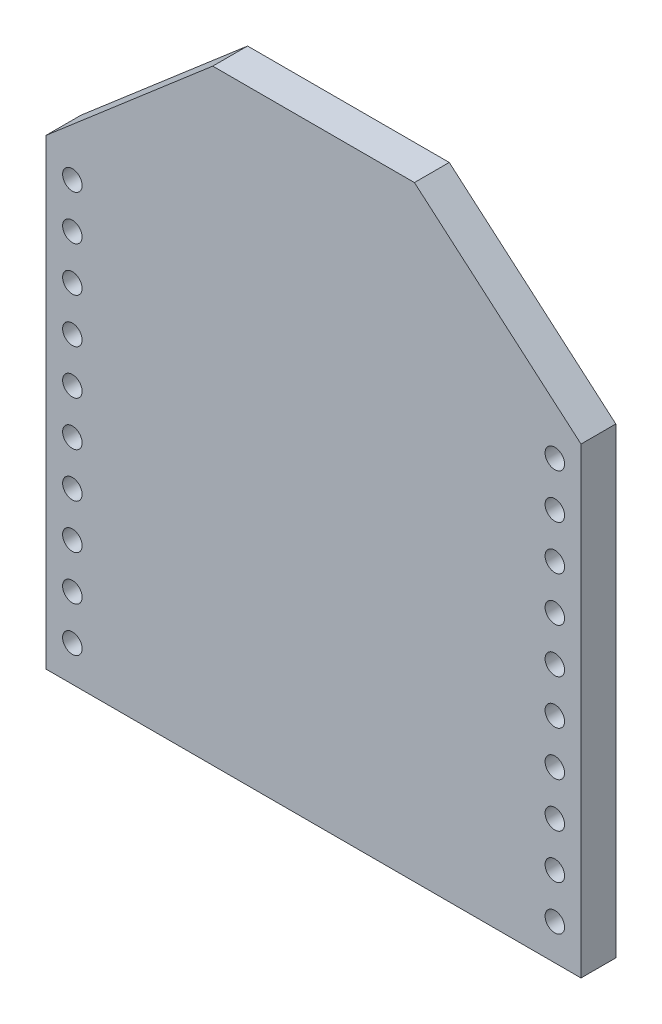
ISO-10303-21;
HEADER;
FILE_DESCRIPTION(('STEP AP214'),'2;1');
FILE_NAME('part.step','',(''),(''),'','','');
FILE_SCHEMA(('AUTOMOTIVE_DESIGN { 1 0 10303 214 1 1 1 1 }'));
ENDSEC;
DATA;
#1=APPLICATION_CONTEXT('core data for automotive mechanical design processes');
#2=APPLICATION_PROTOCOL_DEFINITION('international standard','automotive_design',2000,#1);
#3=PRODUCT_CONTEXT('',#1,'mechanical');
#4=PRODUCT('Part','Part','',(#3));
#5=PRODUCT_RELATED_PRODUCT_CATEGORY('part','',(#4));
#6=PRODUCT_DEFINITION_FORMATION('','',#4);
#7=PRODUCT_DEFINITION_CONTEXT('part definition',#1,'design');
#8=PRODUCT_DEFINITION('design','',#6,#7);
#9=PRODUCT_DEFINITION_SHAPE('','',#8);
#10=(LENGTH_UNIT() NAMED_UNIT(*) SI_UNIT(.MILLI.,.METRE.));
#11=(NAMED_UNIT(*) PLANE_ANGLE_UNIT() SI_UNIT($,.RADIAN.));
#12=(NAMED_UNIT(*) SI_UNIT($,.STERADIAN.) SOLID_ANGLE_UNIT());
#13=UNCERTAINTY_MEASURE_WITH_UNIT(LENGTH_MEASURE(1.E-05),#10,'distance_accuracy_value','');
#14=(GEOMETRIC_REPRESENTATION_CONTEXT(3) GLOBAL_UNCERTAINTY_ASSIGNED_CONTEXT((#13)) GLOBAL_UNIT_ASSIGNED_CONTEXT((#10,
#11,#12)) REPRESENTATION_CONTEXT('',''));
#15=CARTESIAN_POINT('',(0.,0.,0.));
#16=DIRECTION('',(0.,0.,1.));
#17=DIRECTION('',(1.,0.,0.));
#18=AXIS2_PLACEMENT_3D('',#15,#16,#17);
#19=CARTESIAN_POINT('',(0.,0.,1.5875));
#20=DIRECTION('',(0.,0.,-1.));
#21=DIRECTION('',(-1.,0.,0.));
#22=AXIS2_PLACEMENT_3D('',#19,#20,#21);
#23=PLANE('',#22);
#24=DIRECTION('',(0.,-1.,0.));
#25=VECTOR('',#24,1.);
#26=CARTESIAN_POINT('',(-12.192,0.,1.5875));
#27=LINE('',#26,#25);
#28=CARTESIAN_POINT('',(-12.192,21.082,1.5875));
#29=VERTEX_POINT('',#28);
#30=CARTESIAN_POINT('',(-12.192,0.,1.5875));
#31=VERTEX_POINT('',#30);
#32=EDGE_CURVE('E130',#29,#31,#27,.T.);
#33=ORIENTED_EDGE('',*,*,#32,.T.);
#34=DIRECTION('',(1.,0.,0.));
#35=VECTOR('',#34,1.);
#36=CARTESIAN_POINT('',(12.192,0.,1.5875));
#37=LINE('',#36,#35);
#38=CARTESIAN_POINT('',(12.192,0.,1.5875));
#39=VERTEX_POINT('',#38);
#40=EDGE_CURVE('E88',#31,#39,#37,.T.);
#41=ORIENTED_EDGE('',*,*,#40,.T.);
#42=DIRECTION('',(0.,1.,0.));
#43=VECTOR('',#42,1.);
#44=CARTESIAN_POINT('',(12.192,0.,1.5875));
#45=LINE('',#44,#43);
#46=CARTESIAN_POINT('',(12.192,21.082,1.5875));
#47=VERTEX_POINT('',#46);
#48=EDGE_CURVE('E101',#39,#47,#45,.T.);
#49=ORIENTED_EDGE('',*,*,#48,.T.);
#50=DIRECTION('',(-0.75836071111112,0.651835126272769,0.));
#51=VECTOR('',#50,1.);
#52=CARTESIAN_POINT('',(12.192,21.082,1.5875));
#53=LINE('',#52,#51);
#54=CARTESIAN_POINT('',(4.5974,27.6098,1.5875));
#55=VERTEX_POINT('',#54);
#56=EDGE_CURVE('E95',#47,#55,#53,.T.);
#57=ORIENTED_EDGE('',*,*,#56,.T.);
#58=DIRECTION('',(-1.,0.,0.));
#59=VECTOR('',#58,1.);
#60=CARTESIAN_POINT('',(-4.59740000000002,27.6098,1.5875));
#61=LINE('',#60,#59);
#62=CARTESIAN_POINT('',(-4.59740000000002,27.6098,1.5875));
#63=VERTEX_POINT('',#62);
#64=EDGE_CURVE('E99',#55,#63,#61,.T.);
#65=ORIENTED_EDGE('',*,*,#64,.T.);
#66=DIRECTION('',(-0.758360711111119,-0.65183512627277,0.));
#67=VECTOR('',#66,1.);
#68=CARTESIAN_POINT('',(-12.192,21.082,1.5875));
#69=LINE('',#68,#67);
#70=EDGE_CURVE('E51',#63,#29,#69,.T.);
#71=ORIENTED_EDGE('',*,*,#70,.T.);
#72=EDGE_LOOP('',(#33,#41,#49,#57,#65,#71));
#73=FACE_BOUND('',#72,.T.);
#74=CARTESIAN_POINT('',(-10.9982,1.62862192886421,1.5875));
#75=DIRECTION('',(0.,0.,1.));
#76=DIRECTION('',(1.,0.,0.));
#77=AXIS2_PLACEMENT_3D('',#74,#75,#76);
#78=CIRCLE('',#77,0.4445);
#79=CARTESIAN_POINT('',(-10.5537,1.62862192886421,1.5875));
#80=VERTEX_POINT('',#79);
#81=EDGE_CURVE('E123',#80,#80,#78,.T.);
#82=ORIENTED_EDGE('',*,*,#81,.F.);
#83=EDGE_LOOP('',(#82));
#84=FACE_BOUND('',#83,.T.);
#85=CARTESIAN_POINT('',(-10.9982,3.66062192886421,1.5875));
#86=DIRECTION('',(0.,0.,1.));
#87=DIRECTION('',(1.,0.,0.));
#88=AXIS2_PLACEMENT_3D('',#85,#86,#87);
#89=CIRCLE('',#88,0.4445);
#90=CARTESIAN_POINT('',(-10.5537,3.66062192886421,1.5875));
#91=VERTEX_POINT('',#90);
#92=EDGE_CURVE('E354',#91,#91,#89,.T.);
#93=ORIENTED_EDGE('',*,*,#92,.F.);
#94=EDGE_LOOP('',(#93));
#95=FACE_BOUND('',#94,.T.);
#96=CARTESIAN_POINT('',(-10.9982,5.69262192886421,1.5875));
#97=DIRECTION('',(0.,0.,1.));
#98=DIRECTION('',(1.,0.,0.));
#99=AXIS2_PLACEMENT_3D('',#96,#97,#98);
#100=CIRCLE('',#99,0.4445);
#101=CARTESIAN_POINT('',(-10.5537,5.69262192886421,1.5875));
#102=VERTEX_POINT('',#101);
#103=EDGE_CURVE('E348',#102,#102,#100,.T.);
#104=ORIENTED_EDGE('',*,*,#103,.F.);
#105=EDGE_LOOP('',(#104));
#106=FACE_BOUND('',#105,.T.);
#107=CARTESIAN_POINT('',(-10.9982,7.72462192886421,1.5875));
#108=DIRECTION('',(0.,0.,1.));
#109=DIRECTION('',(1.,0.,0.));
#110=AXIS2_PLACEMENT_3D('',#107,#108,#109);
#111=CIRCLE('',#110,0.4445);
#112=CARTESIAN_POINT('',(-10.5537,7.72462192886421,1.5875));
#113=VERTEX_POINT('',#112);
#114=EDGE_CURVE('E342',#113,#113,#111,.T.);
#115=ORIENTED_EDGE('',*,*,#114,.F.);
#116=EDGE_LOOP('',(#115));
#117=FACE_BOUND('',#116,.T.);
#118=CARTESIAN_POINT('',(-10.9982,9.75662192886421,1.5875));
#119=DIRECTION('',(0.,0.,1.));
#120=DIRECTION('',(1.,0.,0.));
#121=AXIS2_PLACEMENT_3D('',#118,#119,#120);
#122=CIRCLE('',#121,0.4445);
#123=CARTESIAN_POINT('',(-10.5537,9.75662192886421,1.5875));
#124=VERTEX_POINT('',#123);
#125=EDGE_CURVE('E336',#124,#124,#122,.T.);
#126=ORIENTED_EDGE('',*,*,#125,.F.);
#127=EDGE_LOOP('',(#126));
#128=FACE_BOUND('',#127,.T.);
#129=CARTESIAN_POINT('',(-10.9982,11.7886219288642,1.5875));
#130=DIRECTION('',(0.,0.,1.));
#131=DIRECTION('',(1.,0.,0.));
#132=AXIS2_PLACEMENT_3D('',#129,#130,#131);
#133=CIRCLE('',#132,0.4445);
#134=CARTESIAN_POINT('',(-10.5537,11.7886219288642,1.5875));
#135=VERTEX_POINT('',#134);
#136=EDGE_CURVE('E330',#135,#135,#133,.T.);
#137=ORIENTED_EDGE('',*,*,#136,.F.);
#138=EDGE_LOOP('',(#137));
#139=FACE_BOUND('',#138,.T.);
#140=CARTESIAN_POINT('',(-10.9982,13.8206219288642,1.5875));
#141=DIRECTION('',(0.,0.,1.));
#142=DIRECTION('',(1.,0.,0.));
#143=AXIS2_PLACEMENT_3D('',#140,#141,#142);
#144=CIRCLE('',#143,0.4445);
#145=CARTESIAN_POINT('',(-10.5537,13.8206219288642,1.5875));
#146=VERTEX_POINT('',#145);
#147=EDGE_CURVE('E324',#146,#146,#144,.T.);
#148=ORIENTED_EDGE('',*,*,#147,.F.);
#149=EDGE_LOOP('',(#148));
#150=FACE_BOUND('',#149,.T.);
#151=CARTESIAN_POINT('',(-10.9982,15.8526219288642,1.5875));
#152=DIRECTION('',(0.,0.,1.));
#153=DIRECTION('',(1.,0.,0.));
#154=AXIS2_PLACEMENT_3D('',#151,#152,#153);
#155=CIRCLE('',#154,0.4445);
#156=CARTESIAN_POINT('',(-10.5537,15.8526219288642,1.5875));
#157=VERTEX_POINT('',#156);
#158=EDGE_CURVE('E318',#157,#157,#155,.T.);
#159=ORIENTED_EDGE('',*,*,#158,.F.);
#160=EDGE_LOOP('',(#159));
#161=FACE_BOUND('',#160,.T.);
#162=CARTESIAN_POINT('',(-10.9982000000001,17.8846219288642,1.5875));
#163=DIRECTION('',(0.,0.,1.));
#164=DIRECTION('',(1.,0.,0.));
#165=AXIS2_PLACEMENT_3D('',#162,#163,#164);
#166=CIRCLE('',#165,0.4445);
#167=CARTESIAN_POINT('',(-10.5537000000001,17.8846219288642,1.5875));
#168=VERTEX_POINT('',#167);
#169=EDGE_CURVE('E312',#168,#168,#166,.T.);
#170=ORIENTED_EDGE('',*,*,#169,.F.);
#171=EDGE_LOOP('',(#170));
#172=FACE_BOUND('',#171,.T.);
#173=CARTESIAN_POINT('',(-10.9982000000001,19.9166219288642,1.5875));
#174=DIRECTION('',(0.,0.,1.));
#175=DIRECTION('',(1.,0.,0.));
#176=AXIS2_PLACEMENT_3D('',#173,#174,#175);
#177=CIRCLE('',#176,0.4445);
#178=CARTESIAN_POINT('',(-10.5537000000001,19.9166219288642,1.5875));
#179=VERTEX_POINT('',#178);
#180=EDGE_CURVE('E306',#179,#179,#177,.T.);
#181=ORIENTED_EDGE('',*,*,#180,.F.);
#182=EDGE_LOOP('',(#181));
#183=FACE_BOUND('',#182,.T.);
#184=CARTESIAN_POINT('',(10.9982000000001,19.9166219288642,1.5875));
#185=DIRECTION('',(0.,0.,1.));
#186=DIRECTION('',(-1.,0.,0.));
#187=AXIS2_PLACEMENT_3D('',#184,#185,#186);
#188=CIRCLE('',#187,0.4445);
#189=CARTESIAN_POINT('',(10.5537000000001,19.9166219288642,1.5875));
#190=VERTEX_POINT('',#189);
#191=EDGE_CURVE('E300',#190,#190,#188,.T.);
#192=ORIENTED_EDGE('',*,*,#191,.F.);
#193=EDGE_LOOP('',(#192));
#194=FACE_BOUND('',#193,.T.);
#195=CARTESIAN_POINT('',(10.9982000000001,17.8846219288642,1.5875));
#196=DIRECTION('',(0.,0.,1.));
#197=DIRECTION('',(-1.,0.,0.));
#198=AXIS2_PLACEMENT_3D('',#195,#196,#197);
#199=CIRCLE('',#198,0.4445);
#200=CARTESIAN_POINT('',(10.5537000000001,17.8846219288642,1.5875));
#201=VERTEX_POINT('',#200);
#202=EDGE_CURVE('E294',#201,#201,#199,.T.);
#203=ORIENTED_EDGE('',*,*,#202,.F.);
#204=EDGE_LOOP('',(#203));
#205=FACE_BOUND('',#204,.T.);
#206=CARTESIAN_POINT('',(10.9982,15.8526219288642,1.5875));
#207=DIRECTION('',(0.,0.,1.));
#208=DIRECTION('',(-1.,0.,0.));
#209=AXIS2_PLACEMENT_3D('',#206,#207,#208);
#210=CIRCLE('',#209,0.4445);
#211=CARTESIAN_POINT('',(10.5537,15.8526219288642,1.5875));
#212=VERTEX_POINT('',#211);
#213=EDGE_CURVE('E288',#212,#212,#210,.T.);
#214=ORIENTED_EDGE('',*,*,#213,.F.);
#215=EDGE_LOOP('',(#214));
#216=FACE_BOUND('',#215,.T.);
#217=CARTESIAN_POINT('',(10.9982,13.8206219288642,1.5875));
#218=DIRECTION('',(0.,0.,1.));
#219=DIRECTION('',(-1.,0.,0.));
#220=AXIS2_PLACEMENT_3D('',#217,#218,#219);
#221=CIRCLE('',#220,0.4445);
#222=CARTESIAN_POINT('',(10.5537,13.8206219288642,1.5875));
#223=VERTEX_POINT('',#222);
#224=EDGE_CURVE('E282',#223,#223,#221,.T.);
#225=ORIENTED_EDGE('',*,*,#224,.F.);
#226=EDGE_LOOP('',(#225));
#227=FACE_BOUND('',#226,.T.);
#228=CARTESIAN_POINT('',(10.9982,11.7886219288642,1.5875));
#229=DIRECTION('',(0.,0.,1.));
#230=DIRECTION('',(-1.,0.,0.));
#231=AXIS2_PLACEMENT_3D('',#228,#229,#230);
#232=CIRCLE('',#231,0.4445);
#233=CARTESIAN_POINT('',(10.5537,11.7886219288642,1.5875));
#234=VERTEX_POINT('',#233);
#235=EDGE_CURVE('E276',#234,#234,#232,.T.);
#236=ORIENTED_EDGE('',*,*,#235,.F.);
#237=EDGE_LOOP('',(#236));
#238=FACE_BOUND('',#237,.T.);
#239=CARTESIAN_POINT('',(10.9982,9.75662192886421,1.5875));
#240=DIRECTION('',(0.,0.,1.));
#241=DIRECTION('',(-1.,0.,0.));
#242=AXIS2_PLACEMENT_3D('',#239,#240,#241);
#243=CIRCLE('',#242,0.4445);
#244=CARTESIAN_POINT('',(10.5537,9.75662192886421,1.5875));
#245=VERTEX_POINT('',#244);
#246=EDGE_CURVE('E270',#245,#245,#243,.T.);
#247=ORIENTED_EDGE('',*,*,#246,.F.);
#248=EDGE_LOOP('',(#247));
#249=FACE_BOUND('',#248,.T.);
#250=CARTESIAN_POINT('',(10.9982,7.72462192886421,1.5875));
#251=DIRECTION('',(0.,0.,1.));
#252=DIRECTION('',(-1.,0.,0.));
#253=AXIS2_PLACEMENT_3D('',#250,#251,#252);
#254=CIRCLE('',#253,0.4445);
#255=CARTESIAN_POINT('',(10.5537,7.72462192886421,1.5875));
#256=VERTEX_POINT('',#255);
#257=EDGE_CURVE('E264',#256,#256,#254,.T.);
#258=ORIENTED_EDGE('',*,*,#257,.F.);
#259=EDGE_LOOP('',(#258));
#260=FACE_BOUND('',#259,.T.);
#261=CARTESIAN_POINT('',(10.9982,5.69262192886421,1.5875));
#262=DIRECTION('',(0.,0.,1.));
#263=DIRECTION('',(-1.,0.,0.));
#264=AXIS2_PLACEMENT_3D('',#261,#262,#263);
#265=CIRCLE('',#264,0.4445);
#266=CARTESIAN_POINT('',(10.5537,5.69262192886421,1.5875));
#267=VERTEX_POINT('',#266);
#268=EDGE_CURVE('E258',#267,#267,#265,.T.);
#269=ORIENTED_EDGE('',*,*,#268,.F.);
#270=EDGE_LOOP('',(#269));
#271=FACE_BOUND('',#270,.T.);
#272=CARTESIAN_POINT('',(10.9982,3.66062192886421,1.5875));
#273=DIRECTION('',(0.,0.,1.));
#274=DIRECTION('',(-1.,0.,0.));
#275=AXIS2_PLACEMENT_3D('',#272,#273,#274);
#276=CIRCLE('',#275,0.4445);
#277=CARTESIAN_POINT('',(10.5537,3.66062192886421,1.5875));
#278=VERTEX_POINT('',#277);
#279=EDGE_CURVE('E252',#278,#278,#276,.T.);
#280=ORIENTED_EDGE('',*,*,#279,.F.);
#281=EDGE_LOOP('',(#280));
#282=FACE_BOUND('',#281,.T.);
#283=CARTESIAN_POINT('',(10.9982,1.62862192886421,1.5875));
#284=DIRECTION('',(0.,0.,1.));
#285=DIRECTION('',(-1.,0.,0.));
#286=AXIS2_PLACEMENT_3D('',#283,#284,#285);
#287=CIRCLE('',#286,0.4445);
#288=CARTESIAN_POINT('',(10.5537,1.62862192886421,1.5875));
#289=VERTEX_POINT('',#288);
#290=EDGE_CURVE('E243',#289,#289,#287,.T.);
#291=ORIENTED_EDGE('',*,*,#290,.F.);
#292=EDGE_LOOP('',(#291));
#293=FACE_BOUND('',#292,.T.);
#294=ADVANCED_FACE('F34',(#73,#84,#95,#106,#117,#128,#139,#150,#161,#172,#183,#194,#205,#216,
#227,#238,#249,#260,#271,#282,#293),#23,.F.);
#295=CARTESIAN_POINT('',(0.,0.,0.));
#296=DIRECTION('',(0.,0.,-1.));
#297=DIRECTION('',(-1.,0.,0.));
#298=AXIS2_PLACEMENT_3D('',#295,#296,#297);
#299=PLANE('',#298);
#300=CARTESIAN_POINT('',(10.9982,3.66062192886421,0.));
#301=DIRECTION('',(0.,0.,1.));
#302=DIRECTION('',(-1.,0.,0.));
#303=AXIS2_PLACEMENT_3D('',#300,#301,#302);
#304=CIRCLE('',#303,0.4445);
#305=CARTESIAN_POINT('',(10.5537,3.66062192886421,0.));
#306=VERTEX_POINT('',#305);
#307=EDGE_CURVE('E249',#306,#306,#304,.T.);
#308=ORIENTED_EDGE('',*,*,#307,.T.);
#309=EDGE_LOOP('',(#308));
#310=FACE_BOUND('',#309,.T.);
#311=CARTESIAN_POINT('',(10.9982,7.72462192886421,0.));
#312=DIRECTION('',(0.,0.,1.));
#313=DIRECTION('',(-1.,0.,0.));
#314=AXIS2_PLACEMENT_3D('',#311,#312,#313);
#315=CIRCLE('',#314,0.4445);
#316=CARTESIAN_POINT('',(10.5537,7.72462192886421,0.));
#317=VERTEX_POINT('',#316);
#318=EDGE_CURVE('E261',#317,#317,#315,.T.);
#319=ORIENTED_EDGE('',*,*,#318,.T.);
#320=EDGE_LOOP('',(#319));
#321=FACE_BOUND('',#320,.T.);
#322=CARTESIAN_POINT('',(10.9982,11.7886219288642,0.));
#323=DIRECTION('',(0.,0.,1.));
#324=DIRECTION('',(-1.,0.,0.));
#325=AXIS2_PLACEMENT_3D('',#322,#323,#324);
#326=CIRCLE('',#325,0.4445);
#327=CARTESIAN_POINT('',(10.5537,11.7886219288642,0.));
#328=VERTEX_POINT('',#327);
#329=EDGE_CURVE('E273',#328,#328,#326,.T.);
#330=ORIENTED_EDGE('',*,*,#329,.T.);
#331=EDGE_LOOP('',(#330));
#332=FACE_BOUND('',#331,.T.);
#333=CARTESIAN_POINT('',(10.9982,15.8526219288642,0.));
#334=DIRECTION('',(0.,0.,1.));
#335=DIRECTION('',(-1.,0.,0.));
#336=AXIS2_PLACEMENT_3D('',#333,#334,#335);
#337=CIRCLE('',#336,0.4445);
#338=CARTESIAN_POINT('',(10.5537,15.8526219288642,0.));
#339=VERTEX_POINT('',#338);
#340=EDGE_CURVE('E285',#339,#339,#337,.T.);
#341=ORIENTED_EDGE('',*,*,#340,.T.);
#342=EDGE_LOOP('',(#341));
#343=FACE_BOUND('',#342,.T.);
#344=CARTESIAN_POINT('',(10.9982000000001,19.9166219288642,0.));
#345=DIRECTION('',(0.,0.,1.));
#346=DIRECTION('',(-1.,0.,0.));
#347=AXIS2_PLACEMENT_3D('',#344,#345,#346);
#348=CIRCLE('',#347,0.4445);
#349=CARTESIAN_POINT('',(10.5537000000001,19.9166219288642,0.));
#350=VERTEX_POINT('',#349);
#351=EDGE_CURVE('E297',#350,#350,#348,.T.);
#352=ORIENTED_EDGE('',*,*,#351,.T.);
#353=EDGE_LOOP('',(#352));
#354=FACE_BOUND('',#353,.T.);
#355=CARTESIAN_POINT('',(-10.9982000000001,17.8846219288642,0.));
#356=DIRECTION('',(0.,0.,1.));
#357=DIRECTION('',(1.,0.,0.));
#358=AXIS2_PLACEMENT_3D('',#355,#356,#357);
#359=CIRCLE('',#358,0.4445);
#360=CARTESIAN_POINT('',(-10.5537000000001,17.8846219288642,0.));
#361=VERTEX_POINT('',#360);
#362=EDGE_CURVE('E309',#361,#361,#359,.T.);
#363=ORIENTED_EDGE('',*,*,#362,.T.);
#364=EDGE_LOOP('',(#363));
#365=FACE_BOUND('',#364,.T.);
#366=CARTESIAN_POINT('',(-10.9982,13.8206219288642,0.));
#367=DIRECTION('',(0.,0.,1.));
#368=DIRECTION('',(1.,0.,0.));
#369=AXIS2_PLACEMENT_3D('',#366,#367,#368);
#370=CIRCLE('',#369,0.4445);
#371=CARTESIAN_POINT('',(-10.5537,13.8206219288642,0.));
#372=VERTEX_POINT('',#371);
#373=EDGE_CURVE('E321',#372,#372,#370,.T.);
#374=ORIENTED_EDGE('',*,*,#373,.T.);
#375=EDGE_LOOP('',(#374));
#376=FACE_BOUND('',#375,.T.);
#377=CARTESIAN_POINT('',(-10.9982,9.75662192886421,0.));
#378=DIRECTION('',(0.,0.,1.));
#379=DIRECTION('',(1.,0.,0.));
#380=AXIS2_PLACEMENT_3D('',#377,#378,#379);
#381=CIRCLE('',#380,0.4445);
#382=CARTESIAN_POINT('',(-10.5537,9.75662192886421,0.));
#383=VERTEX_POINT('',#382);
#384=EDGE_CURVE('E333',#383,#383,#381,.T.);
#385=ORIENTED_EDGE('',*,*,#384,.T.);
#386=EDGE_LOOP('',(#385));
#387=FACE_BOUND('',#386,.T.);
#388=CARTESIAN_POINT('',(-10.9982,5.69262192886421,0.));
#389=DIRECTION('',(0.,0.,1.));
#390=DIRECTION('',(1.,0.,0.));
#391=AXIS2_PLACEMENT_3D('',#388,#389,#390);
#392=CIRCLE('',#391,0.4445);
#393=CARTESIAN_POINT('',(-10.5537,5.69262192886421,0.));
#394=VERTEX_POINT('',#393);
#395=EDGE_CURVE('E345',#394,#394,#392,.T.);
#396=ORIENTED_EDGE('',*,*,#395,.T.);
#397=EDGE_LOOP('',(#396));
#398=FACE_BOUND('',#397,.T.);
#399=CARTESIAN_POINT('',(-10.9982,1.62862192886421,0.));
#400=DIRECTION('',(0.,0.,1.));
#401=DIRECTION('',(1.,0.,0.));
#402=AXIS2_PLACEMENT_3D('',#399,#400,#401);
#403=CIRCLE('',#402,0.4445);
#404=CARTESIAN_POINT('',(-10.5537,1.62862192886421,0.));
#405=VERTEX_POINT('',#404);
#406=EDGE_CURVE('E357',#405,#405,#403,.T.);
#407=ORIENTED_EDGE('',*,*,#406,.T.);
#408=EDGE_LOOP('',(#407));
#409=FACE_BOUND('',#408,.T.);
#410=DIRECTION('',(0.,-1.,0.));
#411=VECTOR('',#410,1.);
#412=CARTESIAN_POINT('',(-12.192,0.,0.));
#413=LINE('',#412,#411);
#414=CARTESIAN_POINT('',(-12.192,21.082,0.));
#415=VERTEX_POINT('',#414);
#416=CARTESIAN_POINT('',(-12.192,0.,0.));
#417=VERTEX_POINT('',#416);
#418=EDGE_CURVE('E119',#415,#417,#413,.T.);
#419=ORIENTED_EDGE('',*,*,#418,.F.);
#420=DIRECTION('',(-0.758360711111119,-0.65183512627277,0.));
#421=VECTOR('',#420,1.);
#422=CARTESIAN_POINT('',(-12.192,21.082,0.));
#423=LINE('',#422,#421);
#424=CARTESIAN_POINT('',(-4.59740000000002,27.6098,0.));
#425=VERTEX_POINT('',#424);
#426=EDGE_CURVE('E80',#425,#415,#423,.T.);
#427=ORIENTED_EDGE('',*,*,#426,.F.);
#428=DIRECTION('',(-1.,0.,0.));
#429=VECTOR('',#428,1.);
#430=CARTESIAN_POINT('',(-4.59740000000002,27.6098,0.));
#431=LINE('',#430,#429);
#432=CARTESIAN_POINT('',(4.5974,27.6098,0.));
#433=VERTEX_POINT('',#432);
#434=EDGE_CURVE('E74',#433,#425,#431,.T.);
#435=ORIENTED_EDGE('',*,*,#434,.F.);
#436=DIRECTION('',(-0.75836071111112,0.651835126272769,0.));
#437=VECTOR('',#436,1.);
#438=CARTESIAN_POINT('',(12.192,21.082,0.));
#439=LINE('',#438,#437);
#440=CARTESIAN_POINT('',(12.192,21.082,0.));
#441=VERTEX_POINT('',#440);
#442=EDGE_CURVE('E109',#441,#433,#439,.T.);
#443=ORIENTED_EDGE('',*,*,#442,.F.);
#444=DIRECTION('',(0.,1.,0.));
#445=VECTOR('',#444,1.);
#446=CARTESIAN_POINT('',(12.192,0.,0.));
#447=LINE('',#446,#445);
#448=CARTESIAN_POINT('',(12.192,0.,0.));
#449=VERTEX_POINT('',#448);
#450=EDGE_CURVE('E125',#449,#441,#447,.T.);
#451=ORIENTED_EDGE('',*,*,#450,.F.);
#452=DIRECTION('',(1.,0.,0.));
#453=VECTOR('',#452,1.);
#454=CARTESIAN_POINT('',(12.192,0.,0.));
#455=LINE('',#454,#453);
#456=EDGE_CURVE('E122',#417,#449,#455,.T.);
#457=ORIENTED_EDGE('',*,*,#456,.F.);
#458=EDGE_LOOP('',(#419,#427,#435,#443,#451,#457));
#459=FACE_BOUND('',#458,.T.);
#460=CARTESIAN_POINT('',(-10.9982,3.66062192886421,0.));
#461=DIRECTION('',(0.,0.,1.));
#462=DIRECTION('',(1.,0.,0.));
#463=AXIS2_PLACEMENT_3D('',#460,#461,#462);
#464=CIRCLE('',#463,0.4445);
#465=CARTESIAN_POINT('',(-10.5537,3.66062192886421,0.));
#466=VERTEX_POINT('',#465);
#467=EDGE_CURVE('E351',#466,#466,#464,.T.);
#468=ORIENTED_EDGE('',*,*,#467,.T.);
#469=EDGE_LOOP('',(#468));
#470=FACE_BOUND('',#469,.T.);
#471=CARTESIAN_POINT('',(-10.9982,7.72462192886421,0.));
#472=DIRECTION('',(0.,0.,1.));
#473=DIRECTION('',(1.,0.,0.));
#474=AXIS2_PLACEMENT_3D('',#471,#472,#473);
#475=CIRCLE('',#474,0.4445);
#476=CARTESIAN_POINT('',(-10.5537,7.72462192886421,0.));
#477=VERTEX_POINT('',#476);
#478=EDGE_CURVE('E339',#477,#477,#475,.T.);
#479=ORIENTED_EDGE('',*,*,#478,.T.);
#480=EDGE_LOOP('',(#479));
#481=FACE_BOUND('',#480,.T.);
#482=CARTESIAN_POINT('',(-10.9982,11.7886219288642,0.));
#483=DIRECTION('',(0.,0.,1.));
#484=DIRECTION('',(1.,0.,0.));
#485=AXIS2_PLACEMENT_3D('',#482,#483,#484);
#486=CIRCLE('',#485,0.4445);
#487=CARTESIAN_POINT('',(-10.5537,11.7886219288642,0.));
#488=VERTEX_POINT('',#487);
#489=EDGE_CURVE('E327',#488,#488,#486,.T.);
#490=ORIENTED_EDGE('',*,*,#489,.T.);
#491=EDGE_LOOP('',(#490));
#492=FACE_BOUND('',#491,.T.);
#493=CARTESIAN_POINT('',(-10.9982,15.8526219288642,0.));
#494=DIRECTION('',(0.,0.,1.));
#495=DIRECTION('',(1.,0.,0.));
#496=AXIS2_PLACEMENT_3D('',#493,#494,#495);
#497=CIRCLE('',#496,0.4445);
#498=CARTESIAN_POINT('',(-10.5537,15.8526219288642,0.));
#499=VERTEX_POINT('',#498);
#500=EDGE_CURVE('E315',#499,#499,#497,.T.);
#501=ORIENTED_EDGE('',*,*,#500,.T.);
#502=EDGE_LOOP('',(#501));
#503=FACE_BOUND('',#502,.T.);
#504=CARTESIAN_POINT('',(-10.9982000000001,19.9166219288642,0.));
#505=DIRECTION('',(0.,0.,1.));
#506=DIRECTION('',(1.,0.,0.));
#507=AXIS2_PLACEMENT_3D('',#504,#505,#506);
#508=CIRCLE('',#507,0.4445);
#509=CARTESIAN_POINT('',(-10.5537000000001,19.9166219288642,0.));
#510=VERTEX_POINT('',#509);
#511=EDGE_CURVE('E303',#510,#510,#508,.T.);
#512=ORIENTED_EDGE('',*,*,#511,.T.);
#513=EDGE_LOOP('',(#512));
#514=FACE_BOUND('',#513,.T.);
#515=CARTESIAN_POINT('',(10.9982000000001,17.8846219288642,0.));
#516=DIRECTION('',(0.,0.,1.));
#517=DIRECTION('',(-1.,0.,0.));
#518=AXIS2_PLACEMENT_3D('',#515,#516,#517);
#519=CIRCLE('',#518,0.4445);
#520=CARTESIAN_POINT('',(10.5537000000001,17.8846219288642,0.));
#521=VERTEX_POINT('',#520);
#522=EDGE_CURVE('E291',#521,#521,#519,.T.);
#523=ORIENTED_EDGE('',*,*,#522,.T.);
#524=EDGE_LOOP('',(#523));
#525=FACE_BOUND('',#524,.T.);
#526=CARTESIAN_POINT('',(10.9982,13.8206219288642,0.));
#527=DIRECTION('',(0.,0.,1.));
#528=DIRECTION('',(-1.,0.,0.));
#529=AXIS2_PLACEMENT_3D('',#526,#527,#528);
#530=CIRCLE('',#529,0.4445);
#531=CARTESIAN_POINT('',(10.5537,13.8206219288642,0.));
#532=VERTEX_POINT('',#531);
#533=EDGE_CURVE('E279',#532,#532,#530,.T.);
#534=ORIENTED_EDGE('',*,*,#533,.T.);
#535=EDGE_LOOP('',(#534));
#536=FACE_BOUND('',#535,.T.);
#537=CARTESIAN_POINT('',(10.9982,9.75662192886421,0.));
#538=DIRECTION('',(0.,0.,1.));
#539=DIRECTION('',(-1.,0.,0.));
#540=AXIS2_PLACEMENT_3D('',#537,#538,#539);
#541=CIRCLE('',#540,0.4445);
#542=CARTESIAN_POINT('',(10.5537,9.75662192886421,0.));
#543=VERTEX_POINT('',#542);
#544=EDGE_CURVE('E267',#543,#543,#541,.T.);
#545=ORIENTED_EDGE('',*,*,#544,.T.);
#546=EDGE_LOOP('',(#545));
#547=FACE_BOUND('',#546,.T.);
#548=CARTESIAN_POINT('',(10.9982,5.69262192886421,0.));
#549=DIRECTION('',(0.,0.,1.));
#550=DIRECTION('',(-1.,0.,0.));
#551=AXIS2_PLACEMENT_3D('',#548,#549,#550);
#552=CIRCLE('',#551,0.4445);
#553=CARTESIAN_POINT('',(10.5537,5.69262192886421,0.));
#554=VERTEX_POINT('',#553);
#555=EDGE_CURVE('E255',#554,#554,#552,.T.);
#556=ORIENTED_EDGE('',*,*,#555,.T.);
#557=EDGE_LOOP('',(#556));
#558=FACE_BOUND('',#557,.T.);
#559=CARTESIAN_POINT('',(10.9982,1.62862192886421,0.));
#560=DIRECTION('',(0.,0.,1.));
#561=DIRECTION('',(-1.,0.,0.));
#562=AXIS2_PLACEMENT_3D('',#559,#560,#561);
#563=CIRCLE('',#562,0.4445);
#564=CARTESIAN_POINT('',(10.5537,1.62862192886421,0.));
#565=VERTEX_POINT('',#564);
#566=EDGE_CURVE('E246',#565,#565,#563,.T.);
#567=ORIENTED_EDGE('',*,*,#566,.T.);
#568=EDGE_LOOP('',(#567));
#569=FACE_BOUND('',#568,.T.);
#570=ADVANCED_FACE('F139',(#310,#321,#332,#343,#354,#365,#376,#387,#398,#409,#459,#470,#481,
#492,#503,#514,#525,#536,#547,#558,#569),#299,.T.);
#571=CARTESIAN_POINT('',(-12.192,0.,1.5875));
#572=DIRECTION('',(1.,0.,0.));
#573=DIRECTION('',(0.,1.,0.));
#574=AXIS2_PLACEMENT_3D('',#571,#572,#573);
#575=PLANE('',#574);
#576=ORIENTED_EDGE('',*,*,#418,.T.);
#577=DIRECTION('',(0.,0.,-1.));
#578=VECTOR('',#577,1.);
#579=CARTESIAN_POINT('',(-12.192,0.,1.5875));
#580=LINE('',#579,#578);
#581=EDGE_CURVE('E11',#31,#417,#580,.T.);
#582=ORIENTED_EDGE('',*,*,#581,.F.);
#583=ORIENTED_EDGE('',*,*,#32,.F.);
#584=DIRECTION('',(0.,0.,-1.));
#585=VECTOR('',#584,1.);
#586=CARTESIAN_POINT('',(-12.192,21.082,1.5875));
#587=LINE('',#586,#585);
#588=EDGE_CURVE('E115',#29,#415,#587,.T.);
#589=ORIENTED_EDGE('',*,*,#588,.T.);
#590=EDGE_LOOP('',(#576,#582,#583,#589));
#591=FACE_BOUND('',#590,.T.);
#592=ADVANCED_FACE('F36',(#591),#575,.F.);
#593=CARTESIAN_POINT('',(12.192,0.,1.5875));
#594=DIRECTION('',(0.,1.,0.));
#595=DIRECTION('',(-1.,0.,0.));
#596=AXIS2_PLACEMENT_3D('',#593,#594,#595);
#597=PLANE('',#596);
#598=ORIENTED_EDGE('',*,*,#456,.T.);
#599=DIRECTION('',(0.,0.,-1.));
#600=VECTOR('',#599,1.);
#601=CARTESIAN_POINT('',(12.192,0.,1.5875));
#602=LINE('',#601,#600);
#603=EDGE_CURVE('E43',#39,#449,#602,.T.);
#604=ORIENTED_EDGE('',*,*,#603,.F.);
#605=ORIENTED_EDGE('',*,*,#40,.F.);
#606=ORIENTED_EDGE('',*,*,#581,.T.);
#607=EDGE_LOOP('',(#598,#604,#605,#606));
#608=FACE_BOUND('',#607,.T.);
#609=ADVANCED_FACE('F561',(#608),#597,.F.);
#610=CARTESIAN_POINT('',(12.192,0.,1.5875));
#611=DIRECTION('',(-1.,0.,0.));
#612=DIRECTION('',(0.,-1.,0.));
#613=AXIS2_PLACEMENT_3D('',#610,#611,#612);
#614=PLANE('',#613);
#615=ORIENTED_EDGE('',*,*,#450,.T.);
#616=DIRECTION('',(0.,0.,-1.));
#617=VECTOR('',#616,1.);
#618=CARTESIAN_POINT('',(12.192,21.082,1.5875));
#619=LINE('',#618,#617);
#620=EDGE_CURVE('E110',#47,#441,#619,.T.);
#621=ORIENTED_EDGE('',*,*,#620,.F.);
#622=ORIENTED_EDGE('',*,*,#48,.F.);
#623=ORIENTED_EDGE('',*,*,#603,.T.);
#624=EDGE_LOOP('',(#615,#621,#622,#623));
#625=FACE_BOUND('',#624,.T.);
#626=ADVANCED_FACE('F136',(#625),#614,.F.);
#627=CARTESIAN_POINT('',(12.192,21.082,1.5875));
#628=DIRECTION('',(-0.651835126272769,-0.75836071111112,0.));
#629=DIRECTION('',(0.75836071111112,-0.651835126272769,0.));
#630=AXIS2_PLACEMENT_3D('',#627,#628,#629);
#631=PLANE('',#630);
#632=ORIENTED_EDGE('',*,*,#442,.T.);
#633=DIRECTION('',(0.,0.,-1.));
#634=VECTOR('',#633,1.);
#635=CARTESIAN_POINT('',(4.5974,27.6098,1.5875));
#636=LINE('',#635,#634);
#637=EDGE_CURVE('E106',#55,#433,#636,.T.);
#638=ORIENTED_EDGE('',*,*,#637,.F.);
#639=ORIENTED_EDGE('',*,*,#56,.F.);
#640=ORIENTED_EDGE('',*,*,#620,.T.);
#641=EDGE_LOOP('',(#632,#638,#639,#640));
#642=FACE_BOUND('',#641,.T.);
#643=ADVANCED_FACE('F107',(#642),#631,.F.);
#644=CARTESIAN_POINT('',(-4.59740000000002,27.6098,1.5875));
#645=DIRECTION('',(0.,-1.,0.));
#646=DIRECTION('',(0.,0.,-1.));
#647=AXIS2_PLACEMENT_3D('',#644,#645,#646);
#648=PLANE('',#647);
#649=ORIENTED_EDGE('',*,*,#434,.T.);
#650=DIRECTION('',(0.,0.,-1.));
#651=VECTOR('',#650,1.);
#652=CARTESIAN_POINT('',(-4.59740000000002,27.6098,1.5875));
#653=LINE('',#652,#651);
#654=EDGE_CURVE('E111',#63,#425,#653,.T.);
#655=ORIENTED_EDGE('',*,*,#654,.F.);
#656=ORIENTED_EDGE('',*,*,#64,.F.);
#657=ORIENTED_EDGE('',*,*,#637,.T.);
#658=EDGE_LOOP('',(#649,#655,#656,#657));
#659=FACE_BOUND('',#658,.T.);
#660=ADVANCED_FACE('F113',(#659),#648,.F.);
#661=CARTESIAN_POINT('',(-12.192,21.082,1.5875));
#662=DIRECTION('',(0.65183512627277,-0.758360711111119,0.));
#663=DIRECTION('',(0.758360711111119,0.65183512627277,0.));
#664=AXIS2_PLACEMENT_3D('',#661,#662,#663);
#665=PLANE('',#664);
#666=ORIENTED_EDGE('',*,*,#426,.T.);
#667=ORIENTED_EDGE('',*,*,#588,.F.);
#668=ORIENTED_EDGE('',*,*,#70,.F.);
#669=ORIENTED_EDGE('',*,*,#654,.T.);
#670=EDGE_LOOP('',(#666,#667,#668,#669));
#671=FACE_BOUND('',#670,.T.);
#672=ADVANCED_FACE('F144',(#671),#665,.F.);
#673=CARTESIAN_POINT('',(-10.9982,1.62862192886421,1.5875));
#674=DIRECTION('',(0.,0.,-1.));
#675=DIRECTION('',(-1.,0.,0.));
#676=AXIS2_PLACEMENT_3D('',#673,#674,#675);
#677=CYLINDRICAL_SURFACE('',#676,0.4445);
#678=ORIENTED_EDGE('',*,*,#81,.T.);
#679=EDGE_LOOP('',(#678));
#680=FACE_BOUND('',#679,.T.);
#681=ORIENTED_EDGE('',*,*,#406,.F.);
#682=EDGE_LOOP('',(#681));
#683=FACE_BOUND('',#682,.T.);
#684=ADVANCED_FACE('F146',(#680,#683),#677,.F.);
#685=CARTESIAN_POINT('',(-10.9982,3.66062192886421,1.5875));
#686=DIRECTION('',(0.,0.,-1.));
#687=DIRECTION('',(-1.,0.,0.));
#688=AXIS2_PLACEMENT_3D('',#685,#686,#687);
#689=CYLINDRICAL_SURFACE('',#688,0.4445);
#690=ORIENTED_EDGE('',*,*,#92,.T.);
#691=EDGE_LOOP('',(#690));
#692=FACE_BOUND('',#691,.T.);
#693=ORIENTED_EDGE('',*,*,#467,.F.);
#694=EDGE_LOOP('',(#693));
#695=FACE_BOUND('',#694,.T.);
#696=ADVANCED_FACE('F152',(#692,#695),#689,.F.);
#697=CARTESIAN_POINT('',(-10.9982,5.69262192886421,1.5875));
#698=DIRECTION('',(0.,0.,-1.));
#699=DIRECTION('',(-1.,0.,0.));
#700=AXIS2_PLACEMENT_3D('',#697,#698,#699);
#701=CYLINDRICAL_SURFACE('',#700,0.4445);
#702=ORIENTED_EDGE('',*,*,#103,.T.);
#703=EDGE_LOOP('',(#702));
#704=FACE_BOUND('',#703,.T.);
#705=ORIENTED_EDGE('',*,*,#395,.F.);
#706=EDGE_LOOP('',(#705));
#707=FACE_BOUND('',#706,.T.);
#708=ADVANCED_FACE('F166',(#704,#707),#701,.F.);
#709=CARTESIAN_POINT('',(-10.9982,7.72462192886421,1.5875));
#710=DIRECTION('',(0.,0.,-1.));
#711=DIRECTION('',(-1.,0.,0.));
#712=AXIS2_PLACEMENT_3D('',#709,#710,#711);
#713=CYLINDRICAL_SURFACE('',#712,0.4445);
#714=ORIENTED_EDGE('',*,*,#114,.T.);
#715=EDGE_LOOP('',(#714));
#716=FACE_BOUND('',#715,.T.);
#717=ORIENTED_EDGE('',*,*,#478,.F.);
#718=EDGE_LOOP('',(#717));
#719=FACE_BOUND('',#718,.T.);
#720=ADVANCED_FACE('F170',(#716,#719),#713,.F.);
#721=CARTESIAN_POINT('',(-10.9982,9.75662192886421,1.5875));
#722=DIRECTION('',(0.,0.,-1.));
#723=DIRECTION('',(-1.,0.,0.));
#724=AXIS2_PLACEMENT_3D('',#721,#722,#723);
#725=CYLINDRICAL_SURFACE('',#724,0.4445);
#726=ORIENTED_EDGE('',*,*,#125,.T.);
#727=EDGE_LOOP('',(#726));
#728=FACE_BOUND('',#727,.T.);
#729=ORIENTED_EDGE('',*,*,#384,.F.);
#730=EDGE_LOOP('',(#729));
#731=FACE_BOUND('',#730,.T.);
#732=ADVANCED_FACE('F174',(#728,#731),#725,.F.);
#733=CARTESIAN_POINT('',(-10.9982,11.7886219288642,1.5875));
#734=DIRECTION('',(0.,0.,-1.));
#735=DIRECTION('',(-1.,0.,0.));
#736=AXIS2_PLACEMENT_3D('',#733,#734,#735);
#737=CYLINDRICAL_SURFACE('',#736,0.4445);
#738=ORIENTED_EDGE('',*,*,#136,.T.);
#739=EDGE_LOOP('',(#738));
#740=FACE_BOUND('',#739,.T.);
#741=ORIENTED_EDGE('',*,*,#489,.F.);
#742=EDGE_LOOP('',(#741));
#743=FACE_BOUND('',#742,.T.);
#744=ADVANCED_FACE('F178',(#740,#743),#737,.F.);
#745=CARTESIAN_POINT('',(-10.9982,13.8206219288642,1.5875));
#746=DIRECTION('',(0.,0.,-1.));
#747=DIRECTION('',(-1.,0.,0.));
#748=AXIS2_PLACEMENT_3D('',#745,#746,#747);
#749=CYLINDRICAL_SURFACE('',#748,0.4445);
#750=ORIENTED_EDGE('',*,*,#147,.T.);
#751=EDGE_LOOP('',(#750));
#752=FACE_BOUND('',#751,.T.);
#753=ORIENTED_EDGE('',*,*,#373,.F.);
#754=EDGE_LOOP('',(#753));
#755=FACE_BOUND('',#754,.T.);
#756=ADVANCED_FACE('F182',(#752,#755),#749,.F.);
#757=CARTESIAN_POINT('',(-10.9982,15.8526219288642,1.5875));
#758=DIRECTION('',(0.,0.,-1.));
#759=DIRECTION('',(-1.,0.,0.));
#760=AXIS2_PLACEMENT_3D('',#757,#758,#759);
#761=CYLINDRICAL_SURFACE('',#760,0.4445);
#762=ORIENTED_EDGE('',*,*,#158,.T.);
#763=EDGE_LOOP('',(#762));
#764=FACE_BOUND('',#763,.T.);
#765=ORIENTED_EDGE('',*,*,#500,.F.);
#766=EDGE_LOOP('',(#765));
#767=FACE_BOUND('',#766,.T.);
#768=ADVANCED_FACE('F186',(#764,#767),#761,.F.);
#769=CARTESIAN_POINT('',(-10.9982000000001,17.8846219288642,1.5875));
#770=DIRECTION('',(0.,0.,-1.));
#771=DIRECTION('',(-1.,0.,0.));
#772=AXIS2_PLACEMENT_3D('',#769,#770,#771);
#773=CYLINDRICAL_SURFACE('',#772,0.4445);
#774=ORIENTED_EDGE('',*,*,#169,.T.);
#775=EDGE_LOOP('',(#774));
#776=FACE_BOUND('',#775,.T.);
#777=ORIENTED_EDGE('',*,*,#362,.F.);
#778=EDGE_LOOP('',(#777));
#779=FACE_BOUND('',#778,.T.);
#780=ADVANCED_FACE('F190',(#776,#779),#773,.F.);
#781=CARTESIAN_POINT('',(-10.9982000000001,19.9166219288642,1.5875));
#782=DIRECTION('',(0.,0.,-1.));
#783=DIRECTION('',(-1.,0.,0.));
#784=AXIS2_PLACEMENT_3D('',#781,#782,#783);
#785=CYLINDRICAL_SURFACE('',#784,0.4445);
#786=ORIENTED_EDGE('',*,*,#180,.T.);
#787=EDGE_LOOP('',(#786));
#788=FACE_BOUND('',#787,.T.);
#789=ORIENTED_EDGE('',*,*,#511,.F.);
#790=EDGE_LOOP('',(#789));
#791=FACE_BOUND('',#790,.T.);
#792=ADVANCED_FACE('F194',(#788,#791),#785,.F.);
#793=CARTESIAN_POINT('',(10.9982000000001,19.9166219288642,1.5875));
#794=DIRECTION('',(0.,0.,-1.));
#795=DIRECTION('',(-1.,0.,0.));
#796=AXIS2_PLACEMENT_3D('',#793,#794,#795);
#797=CYLINDRICAL_SURFACE('',#796,0.4445);
#798=ORIENTED_EDGE('',*,*,#191,.T.);
#799=EDGE_LOOP('',(#798));
#800=FACE_BOUND('',#799,.T.);
#801=ORIENTED_EDGE('',*,*,#351,.F.);
#802=EDGE_LOOP('',(#801));
#803=FACE_BOUND('',#802,.T.);
#804=ADVANCED_FACE('F198',(#800,#803),#797,.F.);
#805=CARTESIAN_POINT('',(10.9982000000001,17.8846219288642,1.5875));
#806=DIRECTION('',(0.,0.,-1.));
#807=DIRECTION('',(-1.,0.,0.));
#808=AXIS2_PLACEMENT_3D('',#805,#806,#807);
#809=CYLINDRICAL_SURFACE('',#808,0.4445);
#810=ORIENTED_EDGE('',*,*,#202,.T.);
#811=EDGE_LOOP('',(#810));
#812=FACE_BOUND('',#811,.T.);
#813=ORIENTED_EDGE('',*,*,#522,.F.);
#814=EDGE_LOOP('',(#813));
#815=FACE_BOUND('',#814,.T.);
#816=ADVANCED_FACE('F202',(#812,#815),#809,.F.);
#817=CARTESIAN_POINT('',(10.9982,15.8526219288642,1.5875));
#818=DIRECTION('',(0.,0.,-1.));
#819=DIRECTION('',(-1.,0.,0.));
#820=AXIS2_PLACEMENT_3D('',#817,#818,#819);
#821=CYLINDRICAL_SURFACE('',#820,0.4445);
#822=ORIENTED_EDGE('',*,*,#213,.T.);
#823=EDGE_LOOP('',(#822));
#824=FACE_BOUND('',#823,.T.);
#825=ORIENTED_EDGE('',*,*,#340,.F.);
#826=EDGE_LOOP('',(#825));
#827=FACE_BOUND('',#826,.T.);
#828=ADVANCED_FACE('F206',(#824,#827),#821,.F.);
#829=CARTESIAN_POINT('',(10.9982,13.8206219288642,1.5875));
#830=DIRECTION('',(0.,0.,-1.));
#831=DIRECTION('',(-1.,0.,0.));
#832=AXIS2_PLACEMENT_3D('',#829,#830,#831);
#833=CYLINDRICAL_SURFACE('',#832,0.4445);
#834=ORIENTED_EDGE('',*,*,#224,.T.);
#835=EDGE_LOOP('',(#834));
#836=FACE_BOUND('',#835,.T.);
#837=ORIENTED_EDGE('',*,*,#533,.F.);
#838=EDGE_LOOP('',(#837));
#839=FACE_BOUND('',#838,.T.);
#840=ADVANCED_FACE('F210',(#836,#839),#833,.F.);
#841=CARTESIAN_POINT('',(10.9982,11.7886219288642,1.5875));
#842=DIRECTION('',(0.,0.,-1.));
#843=DIRECTION('',(-1.,0.,0.));
#844=AXIS2_PLACEMENT_3D('',#841,#842,#843);
#845=CYLINDRICAL_SURFACE('',#844,0.4445);
#846=ORIENTED_EDGE('',*,*,#235,.T.);
#847=EDGE_LOOP('',(#846));
#848=FACE_BOUND('',#847,.T.);
#849=ORIENTED_EDGE('',*,*,#329,.F.);
#850=EDGE_LOOP('',(#849));
#851=FACE_BOUND('',#850,.T.);
#852=ADVANCED_FACE('F214',(#848,#851),#845,.F.);
#853=CARTESIAN_POINT('',(10.9982,9.75662192886421,1.5875));
#854=DIRECTION('',(0.,0.,-1.));
#855=DIRECTION('',(-1.,0.,0.));
#856=AXIS2_PLACEMENT_3D('',#853,#854,#855);
#857=CYLINDRICAL_SURFACE('',#856,0.4445);
#858=ORIENTED_EDGE('',*,*,#246,.T.);
#859=EDGE_LOOP('',(#858));
#860=FACE_BOUND('',#859,.T.);
#861=ORIENTED_EDGE('',*,*,#544,.F.);
#862=EDGE_LOOP('',(#861));
#863=FACE_BOUND('',#862,.T.);
#864=ADVANCED_FACE('F218',(#860,#863),#857,.F.);
#865=CARTESIAN_POINT('',(10.9982,7.72462192886421,1.5875));
#866=DIRECTION('',(0.,0.,-1.));
#867=DIRECTION('',(-1.,0.,0.));
#868=AXIS2_PLACEMENT_3D('',#865,#866,#867);
#869=CYLINDRICAL_SURFACE('',#868,0.4445);
#870=ORIENTED_EDGE('',*,*,#257,.T.);
#871=EDGE_LOOP('',(#870));
#872=FACE_BOUND('',#871,.T.);
#873=ORIENTED_EDGE('',*,*,#318,.F.);
#874=EDGE_LOOP('',(#873));
#875=FACE_BOUND('',#874,.T.);
#876=ADVANCED_FACE('F222',(#872,#875),#869,.F.);
#877=CARTESIAN_POINT('',(10.9982,5.69262192886421,1.5875));
#878=DIRECTION('',(0.,0.,-1.));
#879=DIRECTION('',(-1.,0.,0.));
#880=AXIS2_PLACEMENT_3D('',#877,#878,#879);
#881=CYLINDRICAL_SURFACE('',#880,0.4445);
#882=ORIENTED_EDGE('',*,*,#268,.T.);
#883=EDGE_LOOP('',(#882));
#884=FACE_BOUND('',#883,.T.);
#885=ORIENTED_EDGE('',*,*,#555,.F.);
#886=EDGE_LOOP('',(#885));
#887=FACE_BOUND('',#886,.T.);
#888=ADVANCED_FACE('F226',(#884,#887),#881,.F.);
#889=CARTESIAN_POINT('',(10.9982,3.66062192886421,1.5875));
#890=DIRECTION('',(0.,0.,-1.));
#891=DIRECTION('',(-1.,0.,0.));
#892=AXIS2_PLACEMENT_3D('',#889,#890,#891);
#893=CYLINDRICAL_SURFACE('',#892,0.4445);
#894=ORIENTED_EDGE('',*,*,#279,.T.);
#895=EDGE_LOOP('',(#894));
#896=FACE_BOUND('',#895,.T.);
#897=ORIENTED_EDGE('',*,*,#307,.F.);
#898=EDGE_LOOP('',(#897));
#899=FACE_BOUND('',#898,.T.);
#900=ADVANCED_FACE('F230',(#896,#899),#893,.F.);
#901=CARTESIAN_POINT('',(10.9982,1.62862192886421,1.5875));
#902=DIRECTION('',(0.,0.,-1.));
#903=DIRECTION('',(-1.,0.,0.));
#904=AXIS2_PLACEMENT_3D('',#901,#902,#903);
#905=CYLINDRICAL_SURFACE('',#904,0.4445);
#906=ORIENTED_EDGE('',*,*,#290,.T.);
#907=EDGE_LOOP('',(#906));
#908=FACE_BOUND('',#907,.T.);
#909=ORIENTED_EDGE('',*,*,#566,.F.);
#910=EDGE_LOOP('',(#909));
#911=FACE_BOUND('',#910,.T.);
#912=ADVANCED_FACE('F234',(#908,#911),#905,.F.);
#913=CLOSED_SHELL('',(#294,#570,#592,#609,#626,#643,#660,#672,#684,#696,#708,#720,#732,#744,
#756,#768,#780,#792,#804,#816,#828,#840,#852,#864,#876,#888,#900,#912));
#914=MANIFOLD_SOLID_BREP('B2',#913);
#915=ADVANCED_BREP_SHAPE_REPRESENTATION('',(#18,#914),#14);
#916=SHAPE_DEFINITION_REPRESENTATION(#9,#915);
ENDSEC;
END-ISO-10303-21;
